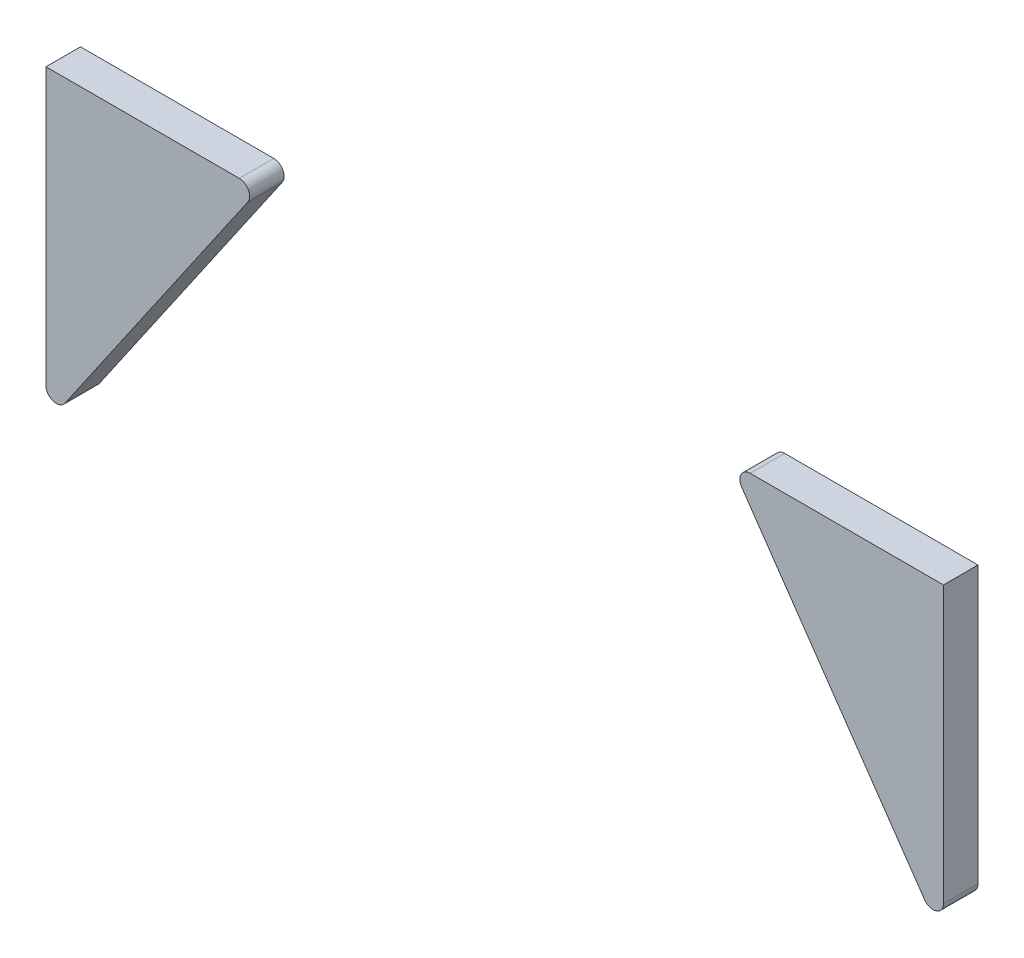
ISO-10303-21;
HEADER;
FILE_DESCRIPTION(('STEP AP214'),'2;1');
FILE_NAME('part.step','',(''),(''),'','','');
FILE_SCHEMA(('AUTOMOTIVE_DESIGN { 1 0 10303 214 1 1 1 1 }'));
ENDSEC;
DATA;
#1=APPLICATION_CONTEXT('core data for automotive mechanical design processes');
#2=APPLICATION_PROTOCOL_DEFINITION('international standard','automotive_design',2000,#1);
#3=PRODUCT_CONTEXT('',#1,'mechanical');
#4=PRODUCT('Part','Part','',(#3));
#5=PRODUCT_RELATED_PRODUCT_CATEGORY('part','',(#4));
#6=PRODUCT_DEFINITION_FORMATION('','',#4);
#7=PRODUCT_DEFINITION_CONTEXT('part definition',#1,'design');
#8=PRODUCT_DEFINITION('design','',#6,#7);
#9=PRODUCT_DEFINITION_SHAPE('','',#8);
#10=(LENGTH_UNIT() NAMED_UNIT(*) SI_UNIT(.MILLI.,.METRE.));
#11=(NAMED_UNIT(*) PLANE_ANGLE_UNIT() SI_UNIT($,.RADIAN.));
#12=(NAMED_UNIT(*) SI_UNIT($,.STERADIAN.) SOLID_ANGLE_UNIT());
#13=UNCERTAINTY_MEASURE_WITH_UNIT(LENGTH_MEASURE(1.E-05),#10,'distance_accuracy_value','');
#14=(GEOMETRIC_REPRESENTATION_CONTEXT(3) GLOBAL_UNCERTAINTY_ASSIGNED_CONTEXT((#13)) GLOBAL_UNIT_ASSIGNED_CONTEXT((#10,
#11,#12)) REPRESENTATION_CONTEXT('',''));
#15=CARTESIAN_POINT('',(0.,0.,0.));
#16=DIRECTION('',(0.,0.,1.));
#17=DIRECTION('',(1.,0.,0.));
#18=AXIS2_PLACEMENT_3D('',#15,#16,#17);
#19=CARTESIAN_POINT('',(65.,10.0457854406131,2.5));
#20=DIRECTION('',(-1.,0.,0.));
#21=DIRECTION('',(0.,-1.,0.));
#22=AXIS2_PLACEMENT_3D('',#19,#20,#21);
#23=PLANE('',#22);
#24=DIRECTION('',(0.,1.,0.));
#25=VECTOR('',#24,1.);
#26=CARTESIAN_POINT('',(65.,10.0457854406131,-2.5));
#27=LINE('',#26,#25);
#28=CARTESIAN_POINT('',(65.,10.0457854406131,-2.5));
#29=VERTEX_POINT('',#28);
#30=CARTESIAN_POINT('',(65.,50.045785440613,-2.5));
#31=VERTEX_POINT('',#30);
#32=EDGE_CURVE('E12',#29,#31,#27,.T.);
#33=ORIENTED_EDGE('',*,*,#32,.T.);
#34=DIRECTION('',(0.,0.,-1.));
#35=VECTOR('',#34,1.);
#36=CARTESIAN_POINT('',(65.,50.045785440613,2.5));
#37=LINE('',#36,#35);
#38=CARTESIAN_POINT('',(65.,50.045785440613,2.5));
#39=VERTEX_POINT('',#38);
#40=EDGE_CURVE('E140',#39,#31,#37,.T.);
#41=ORIENTED_EDGE('',*,*,#40,.F.);
#42=DIRECTION('',(0.,1.,0.));
#43=VECTOR('',#42,1.);
#44=CARTESIAN_POINT('',(65.,10.0457854406131,2.5));
#45=LINE('',#44,#43);
#46=CARTESIAN_POINT('',(65.,10.0457854406131,2.5));
#47=VERTEX_POINT('',#46);
#48=EDGE_CURVE('E57',#47,#39,#45,.T.);
#49=ORIENTED_EDGE('',*,*,#48,.F.);
#50=DIRECTION('',(0.,0.,-1.));
#51=VECTOR('',#50,1.);
#52=CARTESIAN_POINT('',(65.,10.0457854406131,2.5));
#53=LINE('',#52,#51);
#54=EDGE_CURVE('E133',#47,#29,#53,.T.);
#55=ORIENTED_EDGE('',*,*,#54,.T.);
#56=EDGE_LOOP('',(#33,#41,#49,#55));
#57=FACE_BOUND('',#56,.T.);
#58=ADVANCED_FACE('F53',(#57),#23,.F.);
#59=CARTESIAN_POINT('',(65.,50.045785440613,2.5));
#60=DIRECTION('',(0.,-1.,0.));
#61=DIRECTION('',(0.,0.,-1.));
#62=AXIS2_PLACEMENT_3D('',#59,#60,#61);
#63=PLANE('',#62);
#64=DIRECTION('',(-1.,0.,0.));
#65=VECTOR('',#64,1.);
#66=CARTESIAN_POINT('',(65.,50.045785440613,-2.5));
#67=LINE('',#66,#65);
#68=CARTESIAN_POINT('',(37.,50.045785440613,-2.5));
#69=VERTEX_POINT('',#68);
#70=EDGE_CURVE('E63',#31,#69,#67,.T.);
#71=ORIENTED_EDGE('',*,*,#70,.T.);
#72=DIRECTION('',(0.,0.,-1.));
#73=VECTOR('',#72,1.);
#74=CARTESIAN_POINT('',(37.,50.045785440613,2.5));
#75=LINE('',#74,#73);
#76=CARTESIAN_POINT('',(37.,50.045785440613,2.5));
#77=VERTEX_POINT('',#76);
#78=EDGE_CURVE('E115',#77,#69,#75,.T.);
#79=ORIENTED_EDGE('',*,*,#78,.F.);
#80=DIRECTION('',(-1.,0.,0.));
#81=VECTOR('',#80,1.);
#82=CARTESIAN_POINT('',(65.,50.045785440613,2.5));
#83=LINE('',#82,#81);
#84=EDGE_CURVE('E90',#39,#77,#83,.T.);
#85=ORIENTED_EDGE('',*,*,#84,.F.);
#86=ORIENTED_EDGE('',*,*,#40,.T.);
#87=EDGE_LOOP('',(#71,#79,#85,#86));
#88=FACE_BOUND('',#87,.T.);
#89=ADVANCED_FACE('F153',(#88),#63,.F.);
#90=CARTESIAN_POINT('',(37.,48.545785440613,2.5));
#91=DIRECTION('',(0.,0.,-1.));
#92=DIRECTION('',(-1.,0.,0.));
#93=AXIS2_PLACEMENT_3D('',#90,#91,#92);
#94=CYLINDRICAL_SURFACE('',#93,1.49999999999999);
#95=CARTESIAN_POINT('',(37.,48.545785440613,-2.5));
#96=DIRECTION('',(0.,0.,1.));
#97=DIRECTION('',(-1.,0.,0.));
#98=AXIS2_PLACEMENT_3D('',#95,#96,#97);
#99=CIRCLE('',#98,1.49999999999999);
#100=CARTESIAN_POINT('',(35.7644055068792,47.6953113089844,-2.5));
#101=VERTEX_POINT('',#100);
#102=EDGE_CURVE('E109',#69,#101,#99,.T.);
#103=ORIENTED_EDGE('',*,*,#102,.T.);
#104=DIRECTION('',(0.,0.,-1.));
#105=VECTOR('',#104,1.);
#106=CARTESIAN_POINT('',(35.7644055068792,47.6953113089844,2.5));
#107=LINE('',#106,#105);
#108=CARTESIAN_POINT('',(35.7644055068792,47.6953113089844,2.5));
#109=VERTEX_POINT('',#108);
#110=EDGE_CURVE('E113',#109,#101,#107,.T.);
#111=ORIENTED_EDGE('',*,*,#110,.F.);
#112=CARTESIAN_POINT('',(37.,48.545785440613,2.5));
#113=DIRECTION('',(0.,0.,1.));
#114=DIRECTION('',(-1.,0.,0.));
#115=AXIS2_PLACEMENT_3D('',#112,#113,#114);
#116=CIRCLE('',#115,1.49999999999999);
#117=EDGE_CURVE('E135',#77,#109,#116,.T.);
#118=ORIENTED_EDGE('',*,*,#117,.F.);
#119=ORIENTED_EDGE('',*,*,#78,.T.);
#120=EDGE_LOOP('',(#103,#111,#118,#119));
#121=FACE_BOUND('',#120,.T.);
#122=ADVANCED_FACE('F111',(#121),#94,.T.);
#123=CARTESIAN_POINT('',(35.7644055068792,47.6953113089844,2.5));
#124=DIRECTION('',(0.823729662080557,0.566982754419085,0.));
#125=DIRECTION('',(-0.566982754419085,0.823729662080557,0.));
#126=AXIS2_PLACEMENT_3D('',#123,#124,#125);
#127=PLANE('',#126);
#128=DIRECTION('',(0.566982754419085,-0.823729662080557,0.));
#129=VECTOR('',#128,1.);
#130=CARTESIAN_POINT('',(35.7644055068792,47.6953113089844,-2.5));
#131=LINE('',#130,#129);
#132=CARTESIAN_POINT('',(62.2644055068792,9.19531130898443,-2.5));
#133=VERTEX_POINT('',#132);
#134=EDGE_CURVE('E117',#101,#133,#131,.T.);
#135=ORIENTED_EDGE('',*,*,#134,.T.);
#136=DIRECTION('',(0.,0.,-1.));
#137=VECTOR('',#136,1.);
#138=CARTESIAN_POINT('',(62.2644055068792,9.19531130898443,2.5));
#139=LINE('',#138,#137);
#140=CARTESIAN_POINT('',(62.2644055068792,9.19531130898443,2.5));
#141=VERTEX_POINT('',#140);
#142=EDGE_CURVE('E123',#141,#133,#139,.T.);
#143=ORIENTED_EDGE('',*,*,#142,.F.);
#144=DIRECTION('',(0.566982754419085,-0.823729662080557,0.));
#145=VECTOR('',#144,1.);
#146=CARTESIAN_POINT('',(35.7644055068792,47.6953113089844,2.5));
#147=LINE('',#146,#145);
#148=EDGE_CURVE('E122',#109,#141,#147,.T.);
#149=ORIENTED_EDGE('',*,*,#148,.F.);
#150=ORIENTED_EDGE('',*,*,#110,.T.);
#151=EDGE_LOOP('',(#135,#143,#149,#150));
#152=FACE_BOUND('',#151,.T.);
#153=ADVANCED_FACE('F120',(#152),#127,.F.);
#154=CARTESIAN_POINT('',(63.5,10.0457854406131,2.5));
#155=DIRECTION('',(0.,0.,-1.));
#156=DIRECTION('',(-1.,0.,0.));
#157=AXIS2_PLACEMENT_3D('',#154,#155,#156);
#158=CYLINDRICAL_SURFACE('',#157,1.50000000000001);
#159=CARTESIAN_POINT('',(63.5,10.0457854406131,-2.5));
#160=DIRECTION('',(0.,0.,1.));
#161=DIRECTION('',(-1.,0.,0.));
#162=AXIS2_PLACEMENT_3D('',#159,#160,#161);
#163=CIRCLE('',#162,1.50000000000001);
#164=EDGE_CURVE('E101',#133,#29,#163,.T.);
#165=ORIENTED_EDGE('',*,*,#164,.T.);
#166=ORIENTED_EDGE('',*,*,#54,.F.);
#167=CARTESIAN_POINT('',(63.5,10.0457854406131,2.5));
#168=DIRECTION('',(0.,0.,1.));
#169=DIRECTION('',(-1.,0.,0.));
#170=AXIS2_PLACEMENT_3D('',#167,#168,#169);
#171=CIRCLE('',#170,1.50000000000001);
#172=EDGE_CURVE('E131',#141,#47,#171,.T.);
#173=ORIENTED_EDGE('',*,*,#172,.F.);
#174=ORIENTED_EDGE('',*,*,#142,.T.);
#175=EDGE_LOOP('',(#165,#166,#173,#174));
#176=FACE_BOUND('',#175,.T.);
#177=ADVANCED_FACE('F144',(#176),#158,.T.);
#178=CARTESIAN_POINT('',(37.,48.545785440613,2.5));
#179=DIRECTION('',(0.,0.,-1.));
#180=DIRECTION('',(-1.,0.,0.));
#181=AXIS2_PLACEMENT_3D('',#178,#179,#180);
#182=PLANE('',#181);
#183=ORIENTED_EDGE('',*,*,#48,.T.);
#184=ORIENTED_EDGE('',*,*,#84,.T.);
#185=ORIENTED_EDGE('',*,*,#117,.T.);
#186=ORIENTED_EDGE('',*,*,#148,.T.);
#187=ORIENTED_EDGE('',*,*,#172,.T.);
#188=EDGE_LOOP('',(#183,#184,#185,#186,#187));
#189=FACE_BOUND('',#188,.T.);
#190=ADVANCED_FACE('F55',(#189),#182,.F.);
#191=CARTESIAN_POINT('',(37.,48.545785440613,-2.5));
#192=DIRECTION('',(0.,0.,-1.));
#193=DIRECTION('',(-1.,0.,0.));
#194=AXIS2_PLACEMENT_3D('',#191,#192,#193);
#195=PLANE('',#194);
#196=ORIENTED_EDGE('',*,*,#32,.F.);
#197=ORIENTED_EDGE('',*,*,#164,.F.);
#198=ORIENTED_EDGE('',*,*,#134,.F.);
#199=ORIENTED_EDGE('',*,*,#102,.F.);
#200=ORIENTED_EDGE('',*,*,#70,.F.);
#201=EDGE_LOOP('',(#196,#197,#198,#199,#200));
#202=FACE_BOUND('',#201,.T.);
#203=ADVANCED_FACE('F125',(#202),#195,.T.);
#204=CLOSED_SHELL('',(#58,#89,#122,#153,#177,#190,#203));
#205=MANIFOLD_SOLID_BREP('B2',#204);
#206=CARTESIAN_POINT('',(-65.,50.045785440613,2.5));
#207=DIRECTION('',(0.,-1.,0.));
#208=DIRECTION('',(0.,0.,-1.));
#209=AXIS2_PLACEMENT_3D('',#206,#207,#208);
#210=PLANE('',#209);
#211=DIRECTION('',(-1.,0.,0.));
#212=VECTOR('',#211,1.);
#213=CARTESIAN_POINT('',(-65.,50.045785440613,-2.5));
#214=LINE('',#213,#212);
#215=CARTESIAN_POINT('',(-37.,50.045785440613,-2.5));
#216=VERTEX_POINT('',#215);
#217=CARTESIAN_POINT('',(-65.,50.045785440613,-2.5));
#218=VERTEX_POINT('',#217);
#219=EDGE_CURVE('E277',#216,#218,#214,.T.);
#220=ORIENTED_EDGE('',*,*,#219,.T.);
#221=DIRECTION('',(0.,0.,-1.));
#222=VECTOR('',#221,1.);
#223=CARTESIAN_POINT('',(-65.,50.045785440613,2.5));
#224=LINE('',#223,#222);
#225=CARTESIAN_POINT('',(-65.,50.045785440613,2.5));
#226=VERTEX_POINT('',#225);
#227=EDGE_CURVE('E51',#226,#218,#224,.T.);
#228=ORIENTED_EDGE('',*,*,#227,.F.);
#229=DIRECTION('',(-1.,0.,0.));
#230=VECTOR('',#229,1.);
#231=CARTESIAN_POINT('',(-65.,50.045785440613,2.5));
#232=LINE('',#231,#230);
#233=CARTESIAN_POINT('',(-37.,50.045785440613,2.5));
#234=VERTEX_POINT('',#233);
#235=EDGE_CURVE('E285',#234,#226,#232,.T.);
#236=ORIENTED_EDGE('',*,*,#235,.F.);
#237=DIRECTION('',(0.,0.,-1.));
#238=VECTOR('',#237,1.);
#239=CARTESIAN_POINT('',(-37.,50.045785440613,2.5));
#240=LINE('',#239,#238);
#241=EDGE_CURVE('E273',#234,#216,#240,.T.);
#242=ORIENTED_EDGE('',*,*,#241,.T.);
#243=EDGE_LOOP('',(#220,#228,#236,#242));
#244=FACE_BOUND('',#243,.T.);
#245=ADVANCED_FACE('F203',(#244),#210,.F.);
#246=CARTESIAN_POINT('',(-65.,10.045785440613,2.5));
#247=DIRECTION('',(1.,0.,0.));
#248=DIRECTION('',(0.,0.,-1.));
#249=AXIS2_PLACEMENT_3D('',#246,#247,#248);
#250=PLANE('',#249);
#251=DIRECTION('',(0.,-1.,0.));
#252=VECTOR('',#251,1.);
#253=CARTESIAN_POINT('',(-65.,10.045785440613,-2.5));
#254=LINE('',#253,#252);
#255=CARTESIAN_POINT('',(-65.,10.045785440613,-2.5));
#256=VERTEX_POINT('',#255);
#257=EDGE_CURVE('E280',#218,#256,#254,.T.);
#258=ORIENTED_EDGE('',*,*,#257,.T.);
#259=DIRECTION('',(0.,0.,-1.));
#260=VECTOR('',#259,1.);
#261=CARTESIAN_POINT('',(-65.,10.045785440613,2.5));
#262=LINE('',#261,#260);
#263=CARTESIAN_POINT('',(-65.,10.045785440613,2.5));
#264=VERTEX_POINT('',#263);
#265=EDGE_CURVE('E211',#264,#256,#262,.T.);
#266=ORIENTED_EDGE('',*,*,#265,.F.);
#267=DIRECTION('',(0.,-1.,0.));
#268=VECTOR('',#267,1.);
#269=CARTESIAN_POINT('',(-65.,10.045785440613,2.5));
#270=LINE('',#269,#268);
#271=EDGE_CURVE('E253',#226,#264,#270,.T.);
#272=ORIENTED_EDGE('',*,*,#271,.F.);
#273=ORIENTED_EDGE('',*,*,#227,.T.);
#274=EDGE_LOOP('',(#258,#266,#272,#273));
#275=FACE_BOUND('',#274,.T.);
#276=ADVANCED_FACE('F304',(#275),#250,.F.);
#277=CARTESIAN_POINT('',(-63.5,10.045785440613,2.5));
#278=DIRECTION('',(0.,0.,-1.));
#279=DIRECTION('',(-1.,0.,0.));
#280=AXIS2_PLACEMENT_3D('',#277,#278,#279);
#281=CYLINDRICAL_SURFACE('',#280,1.5);
#282=CARTESIAN_POINT('',(-63.5,10.045785440613,-2.5));
#283=DIRECTION('',(0.,0.,1.));
#284=DIRECTION('',(1.,0.,0.));
#285=AXIS2_PLACEMENT_3D('',#282,#283,#284);
#286=CIRCLE('',#285,1.5);
#287=CARTESIAN_POINT('',(-62.2644055068792,9.19531130898441,-2.5));
#288=VERTEX_POINT('',#287);
#289=EDGE_CURVE('E268',#256,#288,#286,.T.);
#290=ORIENTED_EDGE('',*,*,#289,.T.);
#291=DIRECTION('',(0.,0.,-1.));
#292=VECTOR('',#291,1.);
#293=CARTESIAN_POINT('',(-62.2644055068792,9.19531130898441,2.5));
#294=LINE('',#293,#292);
#295=CARTESIAN_POINT('',(-62.2644055068792,9.19531130898441,2.5));
#296=VERTEX_POINT('',#295);
#297=EDGE_CURVE('E265',#296,#288,#294,.T.);
#298=ORIENTED_EDGE('',*,*,#297,.F.);
#299=CARTESIAN_POINT('',(-63.5,10.045785440613,2.5));
#300=DIRECTION('',(0.,0.,1.));
#301=DIRECTION('',(1.,0.,0.));
#302=AXIS2_PLACEMENT_3D('',#299,#300,#301);
#303=CIRCLE('',#302,1.5);
#304=EDGE_CURVE('E257',#264,#296,#303,.T.);
#305=ORIENTED_EDGE('',*,*,#304,.F.);
#306=ORIENTED_EDGE('',*,*,#265,.T.);
#307=EDGE_LOOP('',(#290,#298,#305,#306));
#308=FACE_BOUND('',#307,.T.);
#309=ADVANCED_FACE('F266',(#308),#281,.T.);
#310=CARTESIAN_POINT('',(-35.7644055068792,47.6953113089844,2.5));
#311=DIRECTION('',(-0.823729662080557,0.566982754419085,0.));
#312=DIRECTION('',(-0.566982754419085,-0.823729662080557,0.));
#313=AXIS2_PLACEMENT_3D('',#310,#311,#312);
#314=PLANE('',#313);
#315=DIRECTION('',(0.566982754419085,0.823729662080557,0.));
#316=VECTOR('',#315,1.);
#317=CARTESIAN_POINT('',(-35.7644055068792,47.6953113089844,-2.5));
#318=LINE('',#317,#316);
#319=CARTESIAN_POINT('',(-35.7644055068792,47.6953113089844,-2.5));
#320=VERTEX_POINT('',#319);
#321=EDGE_CURVE('E239',#288,#320,#318,.T.);
#322=ORIENTED_EDGE('',*,*,#321,.T.);
#323=DIRECTION('',(0.,0.,-1.));
#324=VECTOR('',#323,1.);
#325=CARTESIAN_POINT('',(-35.7644055068792,47.6953113089844,2.5));
#326=LINE('',#325,#324);
#327=CARTESIAN_POINT('',(-35.7644055068792,47.6953113089844,2.5));
#328=VERTEX_POINT('',#327);
#329=EDGE_CURVE('E269',#328,#320,#326,.T.);
#330=ORIENTED_EDGE('',*,*,#329,.F.);
#331=DIRECTION('',(0.566982754419085,0.823729662080557,0.));
#332=VECTOR('',#331,1.);
#333=CARTESIAN_POINT('',(-35.7644055068792,47.6953113089844,2.5));
#334=LINE('',#333,#332);
#335=EDGE_CURVE('E261',#296,#328,#334,.T.);
#336=ORIENTED_EDGE('',*,*,#335,.F.);
#337=ORIENTED_EDGE('',*,*,#297,.T.);
#338=EDGE_LOOP('',(#322,#330,#336,#337));
#339=FACE_BOUND('',#338,.T.);
#340=ADVANCED_FACE('F271',(#339),#314,.F.);
#341=CARTESIAN_POINT('',(-37.,48.545785440613,2.5));
#342=DIRECTION('',(0.,0.,-1.));
#343=DIRECTION('',(-1.,0.,0.));
#344=AXIS2_PLACEMENT_3D('',#341,#342,#343);
#345=CYLINDRICAL_SURFACE('',#344,1.5);
#346=CARTESIAN_POINT('',(-37.,48.545785440613,-2.5));
#347=DIRECTION('',(0.,0.,1.));
#348=DIRECTION('',(1.,0.,0.));
#349=AXIS2_PLACEMENT_3D('',#346,#347,#348);
#350=CIRCLE('',#349,1.5);
#351=EDGE_CURVE('E245',#320,#216,#350,.T.);
#352=ORIENTED_EDGE('',*,*,#351,.T.);
#353=ORIENTED_EDGE('',*,*,#241,.F.);
#354=CARTESIAN_POINT('',(-37.,48.545785440613,2.5));
#355=DIRECTION('',(0.,0.,1.));
#356=DIRECTION('',(1.,0.,0.));
#357=AXIS2_PLACEMENT_3D('',#354,#355,#356);
#358=CIRCLE('',#357,1.5);
#359=EDGE_CURVE('E219',#328,#234,#358,.T.);
#360=ORIENTED_EDGE('',*,*,#359,.F.);
#361=ORIENTED_EDGE('',*,*,#329,.T.);
#362=EDGE_LOOP('',(#352,#353,#360,#361));
#363=FACE_BOUND('',#362,.T.);
#364=ADVANCED_FACE('F293',(#363),#345,.T.);
#365=CARTESIAN_POINT('',(-37.,48.545785440613,2.5));
#366=DIRECTION('',(0.,0.,1.));
#367=DIRECTION('',(1.,0.,0.));
#368=AXIS2_PLACEMENT_3D('',#365,#366,#367);
#369=PLANE('',#368);
#370=ORIENTED_EDGE('',*,*,#235,.T.);
#371=ORIENTED_EDGE('',*,*,#271,.T.);
#372=ORIENTED_EDGE('',*,*,#304,.T.);
#373=ORIENTED_EDGE('',*,*,#335,.T.);
#374=ORIENTED_EDGE('',*,*,#359,.T.);
#375=EDGE_LOOP('',(#370,#371,#372,#373,#374));
#376=FACE_BOUND('',#375,.T.);
#377=ADVANCED_FACE('F259',(#376),#369,.T.);
#378=CARTESIAN_POINT('',(-37.,48.545785440613,-2.5));
#379=DIRECTION('',(0.,0.,1.));
#380=DIRECTION('',(1.,0.,0.));
#381=AXIS2_PLACEMENT_3D('',#378,#379,#380);
#382=PLANE('',#381);
#383=ORIENTED_EDGE('',*,*,#219,.F.);
#384=ORIENTED_EDGE('',*,*,#351,.F.);
#385=ORIENTED_EDGE('',*,*,#321,.F.);
#386=ORIENTED_EDGE('',*,*,#289,.F.);
#387=ORIENTED_EDGE('',*,*,#257,.F.);
#388=EDGE_LOOP('',(#383,#384,#385,#386,#387));
#389=FACE_BOUND('',#388,.T.);
#390=ADVANCED_FACE('F289',(#389),#382,.F.);
#391=CLOSED_SHELL('',(#245,#276,#309,#340,#364,#377,#390));
#392=MANIFOLD_SOLID_BREP('B6',#391);
#393=ADVANCED_BREP_SHAPE_REPRESENTATION('',(#18,#205,#392),#14);
#394=SHAPE_DEFINITION_REPRESENTATION(#9,#393);
ENDSEC;
END-ISO-10303-21;
